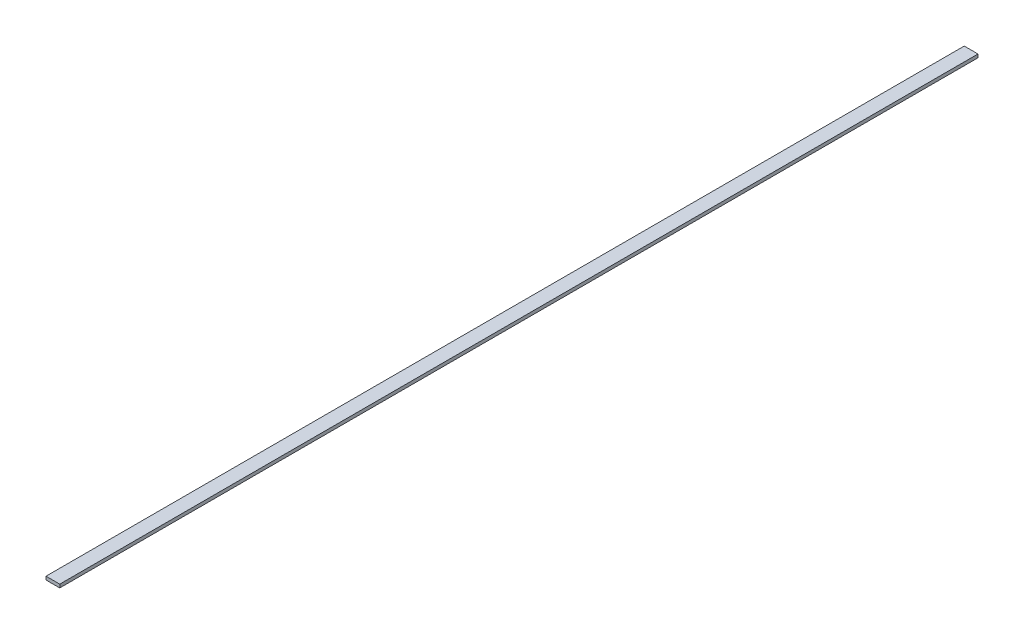
ISO-10303-21;
HEADER;
FILE_DESCRIPTION(('STEP AP214'),'2;1');
FILE_NAME('part.step','',(''),(''),'','','');
FILE_SCHEMA(('AUTOMOTIVE_DESIGN { 1 0 10303 214 1 1 1 1 }'));
ENDSEC;
DATA;
#1=APPLICATION_CONTEXT('core data for automotive mechanical design processes');
#2=APPLICATION_PROTOCOL_DEFINITION('international standard','automotive_design',2000,#1);
#3=PRODUCT_CONTEXT('',#1,'mechanical');
#4=PRODUCT('Part','Part','',(#3));
#5=PRODUCT_RELATED_PRODUCT_CATEGORY('part','',(#4));
#6=PRODUCT_DEFINITION_FORMATION('','',#4);
#7=PRODUCT_DEFINITION_CONTEXT('part definition',#1,'design');
#8=PRODUCT_DEFINITION('design','',#6,#7);
#9=PRODUCT_DEFINITION_SHAPE('','',#8);
#10=(LENGTH_UNIT() NAMED_UNIT(*) SI_UNIT(.MILLI.,.METRE.));
#11=(NAMED_UNIT(*) PLANE_ANGLE_UNIT() SI_UNIT($,.RADIAN.));
#12=(NAMED_UNIT(*) SI_UNIT($,.STERADIAN.) SOLID_ANGLE_UNIT());
#13=UNCERTAINTY_MEASURE_WITH_UNIT(LENGTH_MEASURE(1.E-05),#10,'distance_accuracy_value','');
#14=(GEOMETRIC_REPRESENTATION_CONTEXT(3) GLOBAL_UNCERTAINTY_ASSIGNED_CONTEXT((#13)) GLOBAL_UNIT_ASSIGNED_CONTEXT((#10,
#11,#12)) REPRESENTATION_CONTEXT('',''));
#15=CARTESIAN_POINT('',(0.,0.,0.));
#16=DIRECTION('',(0.,0.,1.));
#17=DIRECTION('',(1.,0.,0.));
#18=AXIS2_PLACEMENT_3D('',#15,#16,#17);
#19=CARTESIAN_POINT('',(0.,1.5,0.));
#20=DIRECTION('',(1.,0.,0.));
#21=DIRECTION('',(0.,0.,-1.));
#22=AXIS2_PLACEMENT_3D('',#19,#20,#21);
#23=PLANE('',#22);
#24=DIRECTION('',(0.,0.,1.));
#25=VECTOR('',#24,1.);
#26=CARTESIAN_POINT('',(0.,0.,0.));
#27=LINE('',#26,#25);
#28=CARTESIAN_POINT('',(0.,0.,-414.));
#29=VERTEX_POINT('',#28);
#30=CARTESIAN_POINT('',(0.,0.,0.));
#31=VERTEX_POINT('',#30);
#32=EDGE_CURVE('E98',#29,#31,#27,.T.);
#33=ORIENTED_EDGE('',*,*,#32,.T.);
#34=DIRECTION('',(0.,-1.,0.));
#35=VECTOR('',#34,1.);
#36=CARTESIAN_POINT('',(0.,1.5,0.));
#37=LINE('',#36,#35);
#38=CARTESIAN_POINT('',(0.,1.5,0.));
#39=VERTEX_POINT('',#38);
#40=EDGE_CURVE('E11',#39,#31,#37,.T.);
#41=ORIENTED_EDGE('',*,*,#40,.F.);
#42=DIRECTION('',(0.,0.,1.));
#43=VECTOR('',#42,1.);
#44=CARTESIAN_POINT('',(0.,1.5,0.));
#45=LINE('',#44,#43);
#46=CARTESIAN_POINT('',(0.,1.5,-414.));
#47=VERTEX_POINT('',#46);
#48=EDGE_CURVE('E86',#47,#39,#45,.T.);
#49=ORIENTED_EDGE('',*,*,#48,.F.);
#50=DIRECTION('',(0.,-1.,0.));
#51=VECTOR('',#50,1.);
#52=CARTESIAN_POINT('',(0.,1.5,-414.));
#53=LINE('',#52,#51);
#54=EDGE_CURVE('E94',#47,#29,#53,.T.);
#55=ORIENTED_EDGE('',*,*,#54,.T.);
#56=EDGE_LOOP('',(#33,#41,#49,#55));
#57=FACE_BOUND('',#56,.T.);
#58=ADVANCED_FACE('F35',(#57),#23,.F.);
#59=CARTESIAN_POINT('',(0.,1.5,0.));
#60=DIRECTION('',(0.,0.,-1.));
#61=DIRECTION('',(-1.,0.,0.));
#62=AXIS2_PLACEMENT_3D('',#59,#60,#61);
#63=PLANE('',#62);
#64=DIRECTION('',(1.,0.,0.));
#65=VECTOR('',#64,1.);
#66=CARTESIAN_POINT('',(0.,0.,0.));
#67=LINE('',#66,#65);
#68=CARTESIAN_POINT('',(6.2,0.,0.));
#69=VERTEX_POINT('',#68);
#70=EDGE_CURVE('E90',#31,#69,#67,.T.);
#71=ORIENTED_EDGE('',*,*,#70,.T.);
#72=DIRECTION('',(0.,-1.,0.));
#73=VECTOR('',#72,1.);
#74=CARTESIAN_POINT('',(6.2,1.5,0.));
#75=LINE('',#74,#73);
#76=CARTESIAN_POINT('',(6.2,1.5,0.));
#77=VERTEX_POINT('',#76);
#78=EDGE_CURVE('E43',#77,#69,#75,.T.);
#79=ORIENTED_EDGE('',*,*,#78,.F.);
#80=DIRECTION('',(1.,0.,0.));
#81=VECTOR('',#80,1.);
#82=CARTESIAN_POINT('',(0.,1.5,0.));
#83=LINE('',#82,#81);
#84=EDGE_CURVE('E81',#39,#77,#83,.T.);
#85=ORIENTED_EDGE('',*,*,#84,.F.);
#86=ORIENTED_EDGE('',*,*,#40,.T.);
#87=EDGE_LOOP('',(#71,#79,#85,#86));
#88=FACE_BOUND('',#87,.T.);
#89=ADVANCED_FACE('F89',(#88),#63,.F.);
#90=CARTESIAN_POINT('',(6.2,1.5,0.));
#91=DIRECTION('',(-1.,0.,0.));
#92=DIRECTION('',(0.,0.,1.));
#93=AXIS2_PLACEMENT_3D('',#90,#91,#92);
#94=PLANE('',#93);
#95=DIRECTION('',(0.,0.,-1.));
#96=VECTOR('',#95,1.);
#97=CARTESIAN_POINT('',(6.2,0.,0.));
#98=LINE('',#97,#96);
#99=CARTESIAN_POINT('',(6.2,0.,-414.));
#100=VERTEX_POINT('',#99);
#101=EDGE_CURVE('E68',#69,#100,#98,.T.);
#102=ORIENTED_EDGE('',*,*,#101,.T.);
#103=DIRECTION('',(0.,-1.,0.));
#104=VECTOR('',#103,1.);
#105=CARTESIAN_POINT('',(6.2,1.5,-414.));
#106=LINE('',#105,#104);
#107=CARTESIAN_POINT('',(6.2,1.5,-414.));
#108=VERTEX_POINT('',#107);
#109=EDGE_CURVE('E91',#108,#100,#106,.T.);
#110=ORIENTED_EDGE('',*,*,#109,.F.);
#111=DIRECTION('',(0.,0.,-1.));
#112=VECTOR('',#111,1.);
#113=CARTESIAN_POINT('',(6.2,1.5,0.));
#114=LINE('',#113,#112);
#115=EDGE_CURVE('E84',#77,#108,#114,.T.);
#116=ORIENTED_EDGE('',*,*,#115,.F.);
#117=ORIENTED_EDGE('',*,*,#78,.T.);
#118=EDGE_LOOP('',(#102,#110,#116,#117));
#119=FACE_BOUND('',#118,.T.);
#120=ADVANCED_FACE('F92',(#119),#94,.F.);
#121=CARTESIAN_POINT('',(0.,1.5,-414.));
#122=DIRECTION('',(0.,0.,1.));
#123=DIRECTION('',(1.,0.,0.));
#124=AXIS2_PLACEMENT_3D('',#121,#122,#123);
#125=PLANE('',#124);
#126=DIRECTION('',(-1.,0.,0.));
#127=VECTOR('',#126,1.);
#128=CARTESIAN_POINT('',(0.,0.,-414.));
#129=LINE('',#128,#127);
#130=EDGE_CURVE('E74',#100,#29,#129,.T.);
#131=ORIENTED_EDGE('',*,*,#130,.T.);
#132=ORIENTED_EDGE('',*,*,#54,.F.);
#133=DIRECTION('',(-1.,0.,0.));
#134=VECTOR('',#133,1.);
#135=CARTESIAN_POINT('',(0.,1.5,-414.));
#136=LINE('',#135,#134);
#137=EDGE_CURVE('E51',#108,#47,#136,.T.);
#138=ORIENTED_EDGE('',*,*,#137,.F.);
#139=ORIENTED_EDGE('',*,*,#109,.T.);
#140=EDGE_LOOP('',(#131,#132,#138,#139));
#141=FACE_BOUND('',#140,.T.);
#142=ADVANCED_FACE('F105',(#141),#125,.F.);
#143=CARTESIAN_POINT('',(0.,1.5,0.));
#144=DIRECTION('',(0.,-1.,0.));
#145=DIRECTION('',(0.,0.,-1.));
#146=AXIS2_PLACEMENT_3D('',#143,#144,#145);
#147=PLANE('',#146);
#148=ORIENTED_EDGE('',*,*,#48,.T.);
#149=ORIENTED_EDGE('',*,*,#84,.T.);
#150=ORIENTED_EDGE('',*,*,#115,.T.);
#151=ORIENTED_EDGE('',*,*,#137,.T.);
#152=EDGE_LOOP('',(#148,#149,#150,#151));
#153=FACE_BOUND('',#152,.T.);
#154=ADVANCED_FACE('F82',(#153),#147,.F.);
#155=CARTESIAN_POINT('',(0.,0.,0.));
#156=DIRECTION('',(0.,-1.,0.));
#157=DIRECTION('',(0.,0.,-1.));
#158=AXIS2_PLACEMENT_3D('',#155,#156,#157);
#159=PLANE('',#158);
#160=ORIENTED_EDGE('',*,*,#32,.F.);
#161=ORIENTED_EDGE('',*,*,#130,.F.);
#162=ORIENTED_EDGE('',*,*,#101,.F.);
#163=ORIENTED_EDGE('',*,*,#70,.F.);
#164=EDGE_LOOP('',(#160,#161,#162,#163));
#165=FACE_BOUND('',#164,.T.);
#166=ADVANCED_FACE('F108',(#165),#159,.T.);
#167=CLOSED_SHELL('',(#58,#89,#120,#142,#154,#166));
#168=MANIFOLD_SOLID_BREP('B2',#167);
#169=ADVANCED_BREP_SHAPE_REPRESENTATION('',(#18,#168),#14);
#170=SHAPE_DEFINITION_REPRESENTATION(#9,#169);
ENDSEC;
END-ISO-10303-21;
